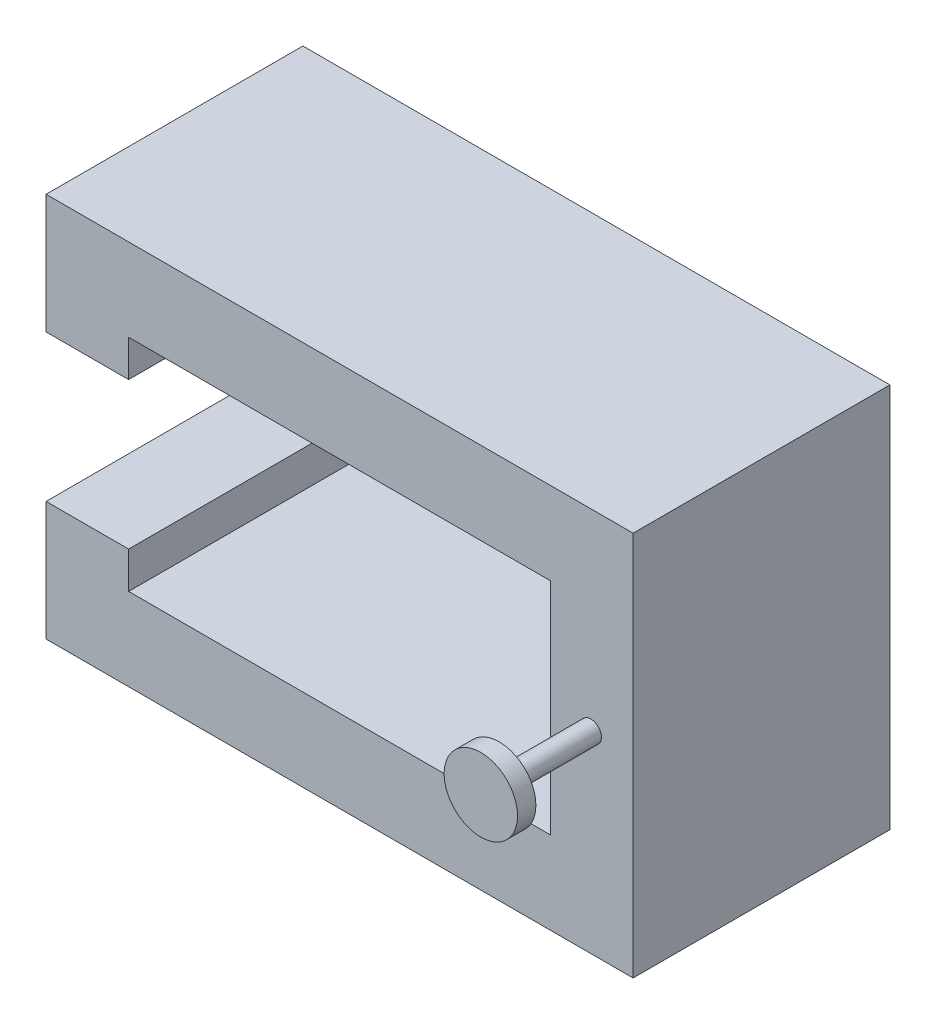
ISO-10303-21;
HEADER;
FILE_DESCRIPTION(('STEP AP214'),'2;1');
FILE_NAME('part.step','',(''),(''),'','','');
FILE_SCHEMA(('AUTOMOTIVE_DESIGN { 1 0 10303 214 1 1 1 1 }'));
ENDSEC;
DATA;
#1=APPLICATION_CONTEXT('core data for automotive mechanical design processes');
#2=APPLICATION_PROTOCOL_DEFINITION('international standard','automotive_design',2000,#1);
#3=PRODUCT_CONTEXT('',#1,'mechanical');
#4=PRODUCT('Part','Part','',(#3));
#5=PRODUCT_RELATED_PRODUCT_CATEGORY('part','',(#4));
#6=PRODUCT_DEFINITION_FORMATION('','',#4);
#7=PRODUCT_DEFINITION_CONTEXT('part definition',#1,'design');
#8=PRODUCT_DEFINITION('design','',#6,#7);
#9=PRODUCT_DEFINITION_SHAPE('','',#8);
#10=(LENGTH_UNIT() NAMED_UNIT(*) SI_UNIT(.MILLI.,.METRE.));
#11=(NAMED_UNIT(*) PLANE_ANGLE_UNIT() SI_UNIT($,.RADIAN.));
#12=(NAMED_UNIT(*) SI_UNIT($,.STERADIAN.) SOLID_ANGLE_UNIT());
#13=UNCERTAINTY_MEASURE_WITH_UNIT(LENGTH_MEASURE(1.E-05),#10,'distance_accuracy_value','');
#14=(GEOMETRIC_REPRESENTATION_CONTEXT(3) GLOBAL_UNCERTAINTY_ASSIGNED_CONTEXT((#13)) GLOBAL_UNIT_ASSIGNED_CONTEXT((#10,
#11,#12)) REPRESENTATION_CONTEXT('',''));
#15=CARTESIAN_POINT('',(0.,0.,0.));
#16=DIRECTION('',(0.,0.,1.));
#17=DIRECTION('',(1.,0.,0.));
#18=AXIS2_PLACEMENT_3D('',#15,#16,#17);
#19=CARTESIAN_POINT('',(0.,14.5,14.));
#20=DIRECTION('',(0.,1.,0.));
#21=DIRECTION('',(0.,0.,1.));
#22=AXIS2_PLACEMENT_3D('',#19,#20,#21);
#23=PLANE('',#22);
#24=DIRECTION('',(1.,0.,0.));
#25=VECTOR('',#24,1.);
#26=CARTESIAN_POINT('',(0.,14.5,0.));
#27=LINE('',#26,#25);
#28=CARTESIAN_POINT('',(0.,14.5,0.));
#29=VERTEX_POINT('',#28);
#30=CARTESIAN_POINT('',(4.5,14.5,0.));
#31=VERTEX_POINT('',#30);
#32=EDGE_CURVE('E157',#29,#31,#27,.T.);
#33=ORIENTED_EDGE('',*,*,#32,.T.);
#34=DIRECTION('',(0.,0.,-1.));
#35=VECTOR('',#34,1.);
#36=CARTESIAN_POINT('',(4.5,14.5,14.));
#37=LINE('',#36,#35);
#38=CARTESIAN_POINT('',(4.5,14.5,14.));
#39=VERTEX_POINT('',#38);
#40=EDGE_CURVE('E11',#39,#31,#37,.T.);
#41=ORIENTED_EDGE('',*,*,#40,.F.);
#42=DIRECTION('',(1.,0.,0.));
#43=VECTOR('',#42,1.);
#44=CARTESIAN_POINT('',(0.,14.5,14.));
#45=LINE('',#44,#43);
#46=CARTESIAN_POINT('',(0.,14.5,14.));
#47=VERTEX_POINT('',#46);
#48=EDGE_CURVE('E188',#47,#39,#45,.T.);
#49=ORIENTED_EDGE('',*,*,#48,.F.);
#50=DIRECTION('',(0.,0.,-1.));
#51=VECTOR('',#50,1.);
#52=CARTESIAN_POINT('',(0.,14.5,14.));
#53=LINE('',#52,#51);
#54=EDGE_CURVE('E51',#47,#29,#53,.T.);
#55=ORIENTED_EDGE('',*,*,#54,.T.);
#56=EDGE_LOOP('',(#33,#41,#49,#55));
#57=FACE_BOUND('',#56,.T.);
#58=ADVANCED_FACE('F35',(#57),#23,.F.);
#59=CARTESIAN_POINT('',(4.5,0.,14.));
#60=DIRECTION('',(-1.,0.,0.));
#61=DIRECTION('',(0.,0.,1.));
#62=AXIS2_PLACEMENT_3D('',#59,#60,#61);
#63=PLANE('',#62);
#64=DIRECTION('',(0.,1.,0.));
#65=VECTOR('',#64,1.);
#66=CARTESIAN_POINT('',(4.5,0.,0.));
#67=LINE('',#66,#65);
#68=CARTESIAN_POINT('',(4.5,16.5,0.));
#69=VERTEX_POINT('',#68);
#70=EDGE_CURVE('E159',#31,#69,#67,.T.);
#71=ORIENTED_EDGE('',*,*,#70,.T.);
#72=DIRECTION('',(0.,0.,-1.));
#73=VECTOR('',#72,1.);
#74=CARTESIAN_POINT('',(4.5,16.5,14.));
#75=LINE('',#74,#73);
#76=CARTESIAN_POINT('',(4.5,16.5,14.));
#77=VERTEX_POINT('',#76);
#78=EDGE_CURVE('E43',#77,#69,#75,.T.);
#79=ORIENTED_EDGE('',*,*,#78,.F.);
#80=DIRECTION('',(0.,1.,0.));
#81=VECTOR('',#80,1.);
#82=CARTESIAN_POINT('',(4.5,0.,14.));
#83=LINE('',#82,#81);
#84=EDGE_CURVE('E101',#39,#77,#83,.T.);
#85=ORIENTED_EDGE('',*,*,#84,.F.);
#86=ORIENTED_EDGE('',*,*,#40,.T.);
#87=EDGE_LOOP('',(#71,#79,#85,#86));
#88=FACE_BOUND('',#87,.T.);
#89=ADVANCED_FACE('F210',(#88),#63,.F.);
#90=CARTESIAN_POINT('',(0.,16.5,14.));
#91=DIRECTION('',(0.,-1.,0.));
#92=DIRECTION('',(0.,0.,-1.));
#93=AXIS2_PLACEMENT_3D('',#90,#91,#92);
#94=PLANE('',#93);
#95=DIRECTION('',(-1.,0.,0.));
#96=VECTOR('',#95,1.);
#97=CARTESIAN_POINT('',(0.,16.5,0.));
#98=LINE('',#97,#96);
#99=CARTESIAN_POINT('',(27.5,16.5,0.));
#100=VERTEX_POINT('',#99);
#101=EDGE_CURVE('E163',#100,#69,#98,.T.);
#102=ORIENTED_EDGE('',*,*,#101,.F.);
#103=DIRECTION('',(0.,0.,-1.));
#104=VECTOR('',#103,1.);
#105=CARTESIAN_POINT('',(27.5,16.5,14.));
#106=LINE('',#105,#104);
#107=CARTESIAN_POINT('',(27.5,16.5,14.));
#108=VERTEX_POINT('',#107);
#109=EDGE_CURVE('E203',#108,#100,#106,.T.);
#110=ORIENTED_EDGE('',*,*,#109,.F.);
#111=DIRECTION('',(-1.,0.,0.));
#112=VECTOR('',#111,1.);
#113=CARTESIAN_POINT('',(0.,16.5,14.));
#114=LINE('',#113,#112);
#115=EDGE_CURVE('E209',#108,#77,#114,.T.);
#116=ORIENTED_EDGE('',*,*,#115,.T.);
#117=ORIENTED_EDGE('',*,*,#78,.T.);
#118=EDGE_LOOP('',(#102,#110,#116,#117));
#119=FACE_BOUND('',#118,.T.);
#120=ADVANCED_FACE('F207',(#119),#94,.T.);
#121=CARTESIAN_POINT('',(27.5,0.,14.));
#122=DIRECTION('',(-1.,0.,0.));
#123=DIRECTION('',(0.,0.,1.));
#124=AXIS2_PLACEMENT_3D('',#121,#122,#123);
#125=PLANE('',#124);
#126=DIRECTION('',(0.,1.,0.));
#127=VECTOR('',#126,1.);
#128=CARTESIAN_POINT('',(27.5,0.,0.));
#129=LINE('',#128,#127);
#130=CARTESIAN_POINT('',(27.5,4.5,0.));
#131=VERTEX_POINT('',#130);
#132=EDGE_CURVE('E166',#131,#100,#129,.T.);
#133=ORIENTED_EDGE('',*,*,#132,.F.);
#134=DIRECTION('',(0.,0.,-1.));
#135=VECTOR('',#134,1.);
#136=CARTESIAN_POINT('',(27.5,4.5,14.));
#137=LINE('',#136,#135);
#138=CARTESIAN_POINT('',(27.5,4.5,14.));
#139=VERTEX_POINT('',#138);
#140=EDGE_CURVE('E201',#139,#131,#137,.T.);
#141=ORIENTED_EDGE('',*,*,#140,.F.);
#142=DIRECTION('',(0.,1.,0.));
#143=VECTOR('',#142,1.);
#144=CARTESIAN_POINT('',(27.5,0.,14.));
#145=LINE('',#144,#143);
#146=EDGE_CURVE('E222',#139,#108,#145,.T.);
#147=ORIENTED_EDGE('',*,*,#146,.T.);
#148=ORIENTED_EDGE('',*,*,#109,.T.);
#149=EDGE_LOOP('',(#133,#141,#147,#148));
#150=FACE_BOUND('',#149,.T.);
#151=ADVANCED_FACE('F218',(#150),#125,.T.);
#152=CARTESIAN_POINT('',(0.,4.5,14.));
#153=DIRECTION('',(0.,-1.,0.));
#154=DIRECTION('',(0.,0.,-1.));
#155=AXIS2_PLACEMENT_3D('',#152,#153,#154);
#156=PLANE('',#155);
#157=DIRECTION('',(-1.,0.,0.));
#158=VECTOR('',#157,1.);
#159=CARTESIAN_POINT('',(0.,4.5,0.));
#160=LINE('',#159,#158);
#161=CARTESIAN_POINT('',(4.5,4.5,0.));
#162=VERTEX_POINT('',#161);
#163=EDGE_CURVE('E169',#131,#162,#160,.T.);
#164=ORIENTED_EDGE('',*,*,#163,.T.);
#165=DIRECTION('',(0.,0.,-1.));
#166=VECTOR('',#165,1.);
#167=CARTESIAN_POINT('',(4.5,4.5,14.));
#168=LINE('',#167,#166);
#169=CARTESIAN_POINT('',(4.5,4.5,14.));
#170=VERTEX_POINT('',#169);
#171=EDGE_CURVE('E198',#170,#162,#168,.T.);
#172=ORIENTED_EDGE('',*,*,#171,.F.);
#173=DIRECTION('',(-1.,0.,0.));
#174=VECTOR('',#173,1.);
#175=CARTESIAN_POINT('',(0.,4.5,14.));
#176=LINE('',#175,#174);
#177=EDGE_CURVE('E224',#139,#170,#176,.T.);
#178=ORIENTED_EDGE('',*,*,#177,.F.);
#179=ORIENTED_EDGE('',*,*,#140,.T.);
#180=EDGE_LOOP('',(#164,#172,#178,#179));
#181=FACE_BOUND('',#180,.T.);
#182=ADVANCED_FACE('F397',(#181),#156,.F.);
#183=CARTESIAN_POINT('',(4.5,0.,14.));
#184=DIRECTION('',(-1.,0.,0.));
#185=DIRECTION('',(0.,0.,1.));
#186=AXIS2_PLACEMENT_3D('',#183,#184,#185);
#187=PLANE('',#186);
#188=DIRECTION('',(0.,1.,0.));
#189=VECTOR('',#188,1.);
#190=CARTESIAN_POINT('',(4.5,0.,0.));
#191=LINE('',#190,#189);
#192=CARTESIAN_POINT('',(4.5,6.5,0.));
#193=VERTEX_POINT('',#192);
#194=EDGE_CURVE('E171',#162,#193,#191,.T.);
#195=ORIENTED_EDGE('',*,*,#194,.T.);
#196=DIRECTION('',(0.,0.,-1.));
#197=VECTOR('',#196,1.);
#198=CARTESIAN_POINT('',(4.5,6.5,14.));
#199=LINE('',#198,#197);
#200=CARTESIAN_POINT('',(4.5,6.5,14.));
#201=VERTEX_POINT('',#200);
#202=EDGE_CURVE('E196',#201,#193,#199,.T.);
#203=ORIENTED_EDGE('',*,*,#202,.F.);
#204=DIRECTION('',(0.,1.,0.));
#205=VECTOR('',#204,1.);
#206=CARTESIAN_POINT('',(4.5,0.,14.));
#207=LINE('',#206,#205);
#208=EDGE_CURVE('E230',#170,#201,#207,.T.);
#209=ORIENTED_EDGE('',*,*,#208,.F.);
#210=ORIENTED_EDGE('',*,*,#171,.T.);
#211=EDGE_LOOP('',(#195,#203,#209,#210));
#212=FACE_BOUND('',#211,.T.);
#213=ADVANCED_FACE('F389',(#212),#187,.F.);
#214=CARTESIAN_POINT('',(0.,6.5,14.));
#215=DIRECTION('',(0.,1.,0.));
#216=DIRECTION('',(0.,0.,1.));
#217=AXIS2_PLACEMENT_3D('',#214,#215,#216);
#218=PLANE('',#217);
#219=DIRECTION('',(1.,0.,0.));
#220=VECTOR('',#219,1.);
#221=CARTESIAN_POINT('',(0.,6.5,0.));
#222=LINE('',#221,#220);
#223=CARTESIAN_POINT('',(0.,6.5,0.));
#224=VERTEX_POINT('',#223);
#225=EDGE_CURVE('E174',#224,#193,#222,.T.);
#226=ORIENTED_EDGE('',*,*,#225,.F.);
#227=DIRECTION('',(0.,0.,-1.));
#228=VECTOR('',#227,1.);
#229=CARTESIAN_POINT('',(0.,6.5,14.));
#230=LINE('',#229,#228);
#231=CARTESIAN_POINT('',(0.,6.5,14.));
#232=VERTEX_POINT('',#231);
#233=EDGE_CURVE('E194',#232,#224,#230,.T.);
#234=ORIENTED_EDGE('',*,*,#233,.F.);
#235=DIRECTION('',(1.,0.,0.));
#236=VECTOR('',#235,1.);
#237=CARTESIAN_POINT('',(0.,6.5,14.));
#238=LINE('',#237,#236);
#239=EDGE_CURVE('E232',#232,#201,#238,.T.);
#240=ORIENTED_EDGE('',*,*,#239,.T.);
#241=ORIENTED_EDGE('',*,*,#202,.T.);
#242=EDGE_LOOP('',(#226,#234,#240,#241));
#243=FACE_BOUND('',#242,.T.);
#244=ADVANCED_FACE('F245',(#243),#218,.T.);
#245=CARTESIAN_POINT('',(0.,0.,14.));
#246=DIRECTION('',(-1.,0.,0.));
#247=DIRECTION('',(0.,0.,1.));
#248=AXIS2_PLACEMENT_3D('',#245,#246,#247);
#249=PLANE('',#248);
#250=DIRECTION('',(0.,1.,0.));
#251=VECTOR('',#250,1.);
#252=CARTESIAN_POINT('',(0.,0.,0.));
#253=LINE('',#252,#251);
#254=CARTESIAN_POINT('',(0.,0.,0.));
#255=VERTEX_POINT('',#254);
#256=EDGE_CURVE('E177',#255,#224,#253,.T.);
#257=ORIENTED_EDGE('',*,*,#256,.F.);
#258=DIRECTION('',(0.,0.,-1.));
#259=VECTOR('',#258,1.);
#260=CARTESIAN_POINT('',(0.,0.,14.));
#261=LINE('',#260,#259);
#262=CARTESIAN_POINT('',(0.,0.,14.));
#263=VERTEX_POINT('',#262);
#264=EDGE_CURVE('E192',#263,#255,#261,.T.);
#265=ORIENTED_EDGE('',*,*,#264,.F.);
#266=DIRECTION('',(0.,1.,0.));
#267=VECTOR('',#266,1.);
#268=CARTESIAN_POINT('',(0.,0.,14.));
#269=LINE('',#268,#267);
#270=EDGE_CURVE('E235',#263,#232,#269,.T.);
#271=ORIENTED_EDGE('',*,*,#270,.T.);
#272=ORIENTED_EDGE('',*,*,#233,.T.);
#273=EDGE_LOOP('',(#257,#265,#271,#272));
#274=FACE_BOUND('',#273,.T.);
#275=ADVANCED_FACE('F239',(#274),#249,.T.);
#276=CARTESIAN_POINT('',(0.,0.,14.));
#277=DIRECTION('',(0.,1.,0.));
#278=DIRECTION('',(0.,0.,1.));
#279=AXIS2_PLACEMENT_3D('',#276,#277,#278);
#280=PLANE('',#279);
#281=DIRECTION('',(1.,0.,0.));
#282=VECTOR('',#281,1.);
#283=CARTESIAN_POINT('',(0.,0.,0.));
#284=LINE('',#283,#282);
#285=CARTESIAN_POINT('',(32.,0.,0.));
#286=VERTEX_POINT('',#285);
#287=EDGE_CURVE('E180',#255,#286,#284,.T.);
#288=ORIENTED_EDGE('',*,*,#287,.T.);
#289=DIRECTION('',(0.,0.,-1.));
#290=VECTOR('',#289,1.);
#291=CARTESIAN_POINT('',(32.,0.,14.));
#292=LINE('',#291,#290);
#293=CARTESIAN_POINT('',(32.,0.,14.));
#294=VERTEX_POINT('',#293);
#295=EDGE_CURVE('E149',#294,#286,#292,.T.);
#296=ORIENTED_EDGE('',*,*,#295,.F.);
#297=DIRECTION('',(1.,0.,0.));
#298=VECTOR('',#297,1.);
#299=CARTESIAN_POINT('',(0.,0.,14.));
#300=LINE('',#299,#298);
#301=EDGE_CURVE('E137',#263,#294,#300,.T.);
#302=ORIENTED_EDGE('',*,*,#301,.F.);
#303=ORIENTED_EDGE('',*,*,#264,.T.);
#304=EDGE_LOOP('',(#288,#296,#302,#303));
#305=FACE_BOUND('',#304,.T.);
#306=ADVANCED_FACE('F248',(#305),#280,.F.);
#307=CARTESIAN_POINT('',(32.,0.,14.));
#308=DIRECTION('',(-1.,0.,0.));
#309=DIRECTION('',(0.,0.,1.));
#310=AXIS2_PLACEMENT_3D('',#307,#308,#309);
#311=PLANE('',#310);
#312=DIRECTION('',(0.,1.,0.));
#313=VECTOR('',#312,1.);
#314=CARTESIAN_POINT('',(32.,0.,0.));
#315=LINE('',#314,#313);
#316=CARTESIAN_POINT('',(32.,21.,0.));
#317=VERTEX_POINT('',#316);
#318=EDGE_CURVE('E146',#286,#317,#315,.T.);
#319=ORIENTED_EDGE('',*,*,#318,.T.);
#320=DIRECTION('',(0.,0.,-1.));
#321=VECTOR('',#320,1.);
#322=CARTESIAN_POINT('',(32.,21.,14.));
#323=LINE('',#322,#321);
#324=CARTESIAN_POINT('',(32.,21.,14.));
#325=VERTEX_POINT('',#324);
#326=EDGE_CURVE('E143',#325,#317,#323,.T.);
#327=ORIENTED_EDGE('',*,*,#326,.F.);
#328=DIRECTION('',(0.,1.,0.));
#329=VECTOR('',#328,1.);
#330=CARTESIAN_POINT('',(32.,0.,14.));
#331=LINE('',#330,#329);
#332=EDGE_CURVE('E129',#294,#325,#331,.T.);
#333=ORIENTED_EDGE('',*,*,#332,.F.);
#334=ORIENTED_EDGE('',*,*,#295,.T.);
#335=EDGE_LOOP('',(#319,#327,#333,#334));
#336=FACE_BOUND('',#335,.T.);
#337=ADVANCED_FACE('F144',(#336),#311,.F.);
#338=CARTESIAN_POINT('',(0.,21.,14.));
#339=DIRECTION('',(0.,1.,0.));
#340=DIRECTION('',(0.,0.,1.));
#341=AXIS2_PLACEMENT_3D('',#338,#339,#340);
#342=PLANE('',#341);
#343=DIRECTION('',(1.,0.,0.));
#344=VECTOR('',#343,1.);
#345=CARTESIAN_POINT('',(0.,21.,0.));
#346=LINE('',#345,#344);
#347=CARTESIAN_POINT('',(0.,21.,0.));
#348=VERTEX_POINT('',#347);
#349=EDGE_CURVE('E183',#348,#317,#346,.T.);
#350=ORIENTED_EDGE('',*,*,#349,.F.);
#351=DIRECTION('',(0.,0.,-1.));
#352=VECTOR('',#351,1.);
#353=CARTESIAN_POINT('',(0.,21.,14.));
#354=LINE('',#353,#352);
#355=CARTESIAN_POINT('',(0.,21.,14.));
#356=VERTEX_POINT('',#355);
#357=EDGE_CURVE('E89',#356,#348,#354,.T.);
#358=ORIENTED_EDGE('',*,*,#357,.F.);
#359=DIRECTION('',(1.,0.,0.));
#360=VECTOR('',#359,1.);
#361=CARTESIAN_POINT('',(0.,21.,14.));
#362=LINE('',#361,#360);
#363=EDGE_CURVE('E134',#356,#325,#362,.T.);
#364=ORIENTED_EDGE('',*,*,#363,.T.);
#365=ORIENTED_EDGE('',*,*,#326,.T.);
#366=EDGE_LOOP('',(#350,#358,#364,#365));
#367=FACE_BOUND('',#366,.T.);
#368=ADVANCED_FACE('F151',(#367),#342,.T.);
#369=CARTESIAN_POINT('',(0.,0.,14.));
#370=DIRECTION('',(-1.,0.,0.));
#371=DIRECTION('',(0.,0.,1.));
#372=AXIS2_PLACEMENT_3D('',#369,#370,#371);
#373=PLANE('',#372);
#374=DIRECTION('',(0.,1.,0.));
#375=VECTOR('',#374,1.);
#376=CARTESIAN_POINT('',(0.,0.,0.));
#377=LINE('',#376,#375);
#378=EDGE_CURVE('E185',#29,#348,#377,.T.);
#379=ORIENTED_EDGE('',*,*,#378,.F.);
#380=ORIENTED_EDGE('',*,*,#54,.F.);
#381=DIRECTION('',(0.,1.,0.));
#382=VECTOR('',#381,1.);
#383=CARTESIAN_POINT('',(0.,0.,14.));
#384=LINE('',#383,#382);
#385=EDGE_CURVE('E152',#47,#356,#384,.T.);
#386=ORIENTED_EDGE('',*,*,#385,.T.);
#387=ORIENTED_EDGE('',*,*,#357,.T.);
#388=EDGE_LOOP('',(#379,#380,#386,#387));
#389=FACE_BOUND('',#388,.T.);
#390=ADVANCED_FACE('F261',(#389),#373,.T.);
#391=CARTESIAN_POINT('',(0.,0.,14.));
#392=DIRECTION('',(0.,0.,1.));
#393=DIRECTION('',(1.,0.,0.));
#394=AXIS2_PLACEMENT_3D('',#391,#392,#393);
#395=PLANE('',#394);
#396=CARTESIAN_POINT('',(29.7,10.5,14.));
#397=DIRECTION('',(0.,0.,1.));
#398=DIRECTION('',(1.,0.,0.));
#399=AXIS2_PLACEMENT_3D('',#396,#397,#398);
#400=CIRCLE('',#399,0.574999999999998);
#401=CARTESIAN_POINT('',(30.275,10.5,14.));
#402=VERTEX_POINT('',#401);
#403=EDGE_CURVE('E294',#402,#402,#400,.T.);
#404=ORIENTED_EDGE('',*,*,#403,.F.);
#405=EDGE_LOOP('',(#404));
#406=FACE_BOUND('',#405,.T.);
#407=ORIENTED_EDGE('',*,*,#48,.T.);
#408=ORIENTED_EDGE('',*,*,#84,.T.);
#409=ORIENTED_EDGE('',*,*,#115,.F.);
#410=ORIENTED_EDGE('',*,*,#146,.F.);
#411=ORIENTED_EDGE('',*,*,#177,.T.);
#412=ORIENTED_EDGE('',*,*,#208,.T.);
#413=ORIENTED_EDGE('',*,*,#239,.F.);
#414=ORIENTED_EDGE('',*,*,#270,.F.);
#415=ORIENTED_EDGE('',*,*,#301,.T.);
#416=ORIENTED_EDGE('',*,*,#332,.T.);
#417=ORIENTED_EDGE('',*,*,#363,.F.);
#418=ORIENTED_EDGE('',*,*,#385,.F.);
#419=EDGE_LOOP('',(#407,#408,#409,#410,#411,#412,#413,#414,#415,#416,#417,#418));
#420=FACE_BOUND('',#419,.T.);
#421=ADVANCED_FACE('F131',(#406,#420),#395,.T.);
#422=CARTESIAN_POINT('',(0.,0.,0.));
#423=DIRECTION('',(0.,0.,1.));
#424=DIRECTION('',(1.,0.,0.));
#425=AXIS2_PLACEMENT_3D('',#422,#423,#424);
#426=PLANE('',#425);
#427=ORIENTED_EDGE('',*,*,#32,.F.);
#428=ORIENTED_EDGE('',*,*,#378,.T.);
#429=ORIENTED_EDGE('',*,*,#349,.T.);
#430=ORIENTED_EDGE('',*,*,#318,.F.);
#431=ORIENTED_EDGE('',*,*,#287,.F.);
#432=ORIENTED_EDGE('',*,*,#256,.T.);
#433=ORIENTED_EDGE('',*,*,#225,.T.);
#434=ORIENTED_EDGE('',*,*,#194,.F.);
#435=ORIENTED_EDGE('',*,*,#163,.F.);
#436=ORIENTED_EDGE('',*,*,#132,.T.);
#437=ORIENTED_EDGE('',*,*,#101,.T.);
#438=ORIENTED_EDGE('',*,*,#70,.F.);
#439=EDGE_LOOP('',(#427,#428,#429,#430,#431,#432,#433,#434,#435,#436,#437,#438));
#440=FACE_BOUND('',#439,.T.);
#441=ADVANCED_FACE('F213',(#440),#426,.F.);
#442=CARTESIAN_POINT('',(29.7,10.5,19.));
#443=DIRECTION('',(0.,0.,-1.));
#444=DIRECTION('',(-1.,0.,0.));
#445=AXIS2_PLACEMENT_3D('',#442,#443,#444);
#446=CYLINDRICAL_SURFACE('',#445,0.574999999999998);
#447=CARTESIAN_POINT('',(29.7,10.5,19.));
#448=DIRECTION('',(0.,0.,1.));
#449=DIRECTION('',(1.,0.,0.));
#450=AXIS2_PLACEMENT_3D('',#447,#448,#449);
#451=CIRCLE('',#450,0.574999999999998);
#452=CARTESIAN_POINT('',(30.275,10.5,19.));
#453=VERTEX_POINT('',#452);
#454=EDGE_CURVE('E160',#453,#453,#451,.T.);
#455=ORIENTED_EDGE('',*,*,#454,.F.);
#456=EDGE_LOOP('',(#455));
#457=FACE_BOUND('',#456,.T.);
#458=ORIENTED_EDGE('',*,*,#403,.T.);
#459=EDGE_LOOP('',(#458));
#460=FACE_BOUND('',#459,.T.);
#461=ADVANCED_FACE('F273',(#457,#460),#446,.T.);
#462=CARTESIAN_POINT('',(29.7,10.5,20.));
#463=DIRECTION('',(0.,0.,-1.));
#464=DIRECTION('',(-1.,0.,0.));
#465=AXIS2_PLACEMENT_3D('',#462,#463,#464);
#466=CYLINDRICAL_SURFACE('',#465,2.);
#467=CARTESIAN_POINT('',(29.7,10.5,20.));
#468=DIRECTION('',(0.,0.,1.));
#469=DIRECTION('',(1.,0.,0.));
#470=AXIS2_PLACEMENT_3D('',#467,#468,#469);
#471=CIRCLE('',#470,2.);
#472=CARTESIAN_POINT('',(31.7,10.5,20.));
#473=VERTEX_POINT('',#472);
#474=EDGE_CURVE('E293',#473,#473,#471,.T.);
#475=ORIENTED_EDGE('',*,*,#474,.F.);
#476=EDGE_LOOP('',(#475));
#477=FACE_BOUND('',#476,.T.);
#478=CARTESIAN_POINT('',(29.7,10.5,19.));
#479=DIRECTION('',(0.,0.,1.));
#480=DIRECTION('',(1.,0.,0.));
#481=AXIS2_PLACEMENT_3D('',#478,#479,#480);
#482=CIRCLE('',#481,2.);
#483=CARTESIAN_POINT('',(31.7,10.5,19.));
#484=VERTEX_POINT('',#483);
#485=EDGE_CURVE('E295',#484,#484,#482,.T.);
#486=ORIENTED_EDGE('',*,*,#485,.T.);
#487=EDGE_LOOP('',(#486));
#488=FACE_BOUND('',#487,.T.);
#489=ADVANCED_FACE('F277',(#477,#488),#466,.T.);
#490=CARTESIAN_POINT('',(29.7,10.5,20.));
#491=DIRECTION('',(0.,0.,1.));
#492=DIRECTION('',(1.,0.,0.));
#493=AXIS2_PLACEMENT_3D('',#490,#491,#492);
#494=PLANE('',#493);
#495=ORIENTED_EDGE('',*,*,#474,.T.);
#496=EDGE_LOOP('',(#495));
#497=FACE_BOUND('',#496,.T.);
#498=ADVANCED_FACE('F281',(#497),#494,.T.);
#499=CARTESIAN_POINT('',(29.7,10.5,19.));
#500=DIRECTION('',(0.,0.,1.));
#501=DIRECTION('',(1.,0.,0.));
#502=AXIS2_PLACEMENT_3D('',#499,#500,#501);
#503=PLANE('',#502);
#504=ORIENTED_EDGE('',*,*,#454,.T.);
#505=EDGE_LOOP('',(#504));
#506=FACE_BOUND('',#505,.T.);
#507=ORIENTED_EDGE('',*,*,#485,.F.);
#508=EDGE_LOOP('',(#507));
#509=FACE_BOUND('',#508,.T.);
#510=ADVANCED_FACE('F283',(#506,#509),#503,.F.);
#511=CLOSED_SHELL('',(#58,#89,#120,#151,#182,#213,#244,#275,#306,#337,#368,#390,#421,#441,#461,
#489,#498,#510));
#512=MANIFOLD_SOLID_BREP('B2',#511);
#513=ADVANCED_BREP_SHAPE_REPRESENTATION('',(#18,#512),#14);
#514=SHAPE_DEFINITION_REPRESENTATION(#9,#513);
ENDSEC;
END-ISO-10303-21;
